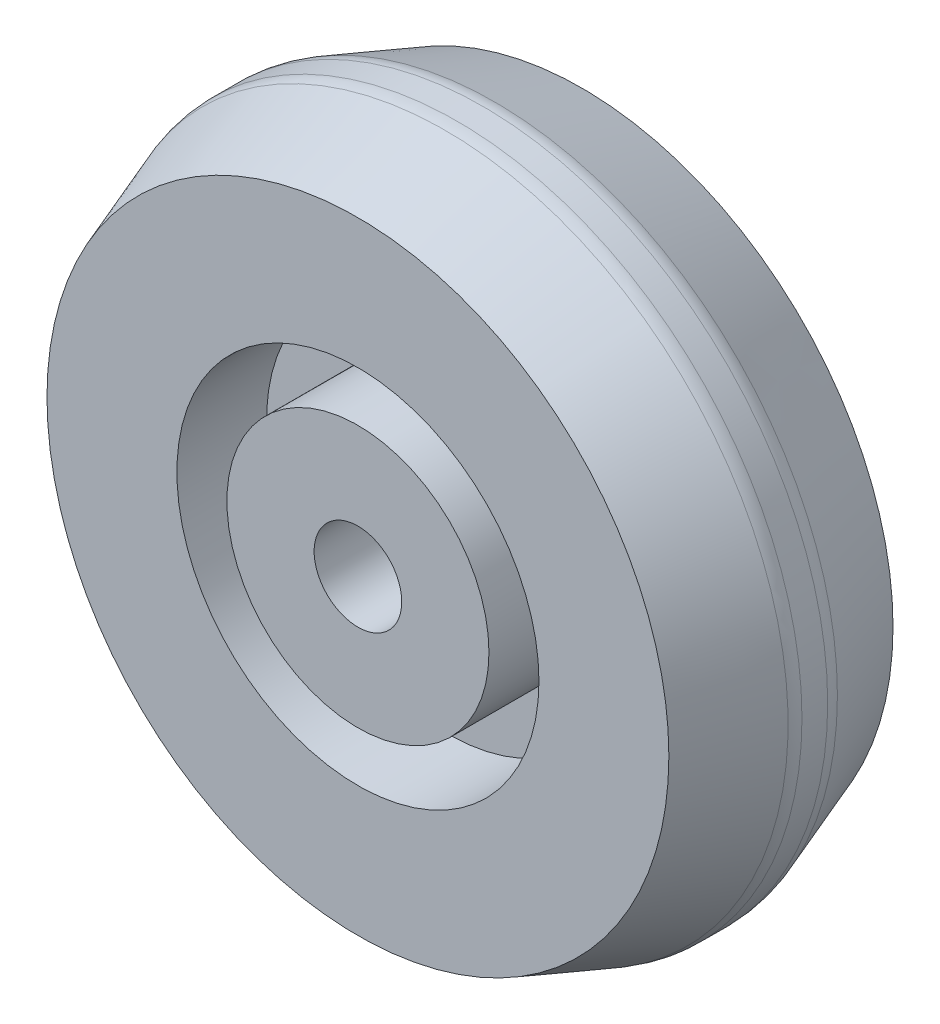
ISO-10303-21;
HEADER;
FILE_DESCRIPTION(('STEP AP214'),'2;1');
FILE_NAME('part.step','',(''),(''),'','','');
FILE_SCHEMA(('AUTOMOTIVE_DESIGN { 1 0 10303 214 1 1 1 1 }'));
ENDSEC;
DATA;
#1=APPLICATION_CONTEXT('core data for automotive mechanical design processes');
#2=APPLICATION_PROTOCOL_DEFINITION('international standard','automotive_design',2000,#1);
#3=PRODUCT_CONTEXT('',#1,'mechanical');
#4=PRODUCT('Part','Part','',(#3));
#5=PRODUCT_RELATED_PRODUCT_CATEGORY('part','',(#4));
#6=PRODUCT_DEFINITION_FORMATION('','',#4);
#7=PRODUCT_DEFINITION_CONTEXT('part definition',#1,'design');
#8=PRODUCT_DEFINITION('design','',#6,#7);
#9=PRODUCT_DEFINITION_SHAPE('','',#8);
#10=(LENGTH_UNIT() NAMED_UNIT(*) SI_UNIT(.MILLI.,.METRE.));
#11=(NAMED_UNIT(*) PLANE_ANGLE_UNIT() SI_UNIT($,.RADIAN.));
#12=(NAMED_UNIT(*) SI_UNIT($,.STERADIAN.) SOLID_ANGLE_UNIT());
#13=UNCERTAINTY_MEASURE_WITH_UNIT(LENGTH_MEASURE(1.E-05),#10,'distance_accuracy_value','');
#14=(GEOMETRIC_REPRESENTATION_CONTEXT(3) GLOBAL_UNCERTAINTY_ASSIGNED_CONTEXT((#13)) GLOBAL_UNIT_ASSIGNED_CONTEXT((#10,
#11,#12)) REPRESENTATION_CONTEXT('',''));
#15=CARTESIAN_POINT('',(0.,0.,0.));
#16=DIRECTION('',(0.,0.,1.));
#17=DIRECTION('',(1.,0.,0.));
#18=AXIS2_PLACEMENT_3D('',#15,#16,#17);
#19=CARTESIAN_POINT('',(0.,0.,-8.255));
#20=DIRECTION('',(0.,0.,1.));
#21=DIRECTION('',(1.,0.,0.));
#22=AXIS2_PLACEMENT_3D('',#19,#20,#21);
#23=PLANE('',#22);
#24=CARTESIAN_POINT('',(0.,0.,-8.255));
#25=DIRECTION('',(0.,0.,1.));
#26=DIRECTION('',(1.,0.,0.));
#27=AXIS2_PLACEMENT_3D('',#24,#25,#26);
#28=CIRCLE('',#27,3.2258);
#29=CARTESIAN_POINT('',(3.2258,0.,-8.255));
#30=VERTEX_POINT('',#29);
#31=EDGE_CURVE('E59',#30,#30,#28,.T.);
#32=ORIENTED_EDGE('',*,*,#31,.T.);
#33=EDGE_LOOP('',(#32));
#34=FACE_BOUND('',#33,.T.);
#35=CARTESIAN_POINT('',(0.,0.,-8.255));
#36=DIRECTION('',(0.,0.,1.));
#37=DIRECTION('',(1.,0.,0.));
#38=AXIS2_PLACEMENT_3D('',#35,#36,#37);
#39=CIRCLE('',#38,9.652);
#40=CARTESIAN_POINT('',(-9.652,0.,-8.255));
#41=VERTEX_POINT('',#40);
#42=EDGE_CURVE('E84',#41,#41,#39,.T.);
#43=ORIENTED_EDGE('',*,*,#42,.F.);
#44=EDGE_LOOP('',(#43));
#45=FACE_BOUND('',#44,.T.);
#46=ADVANCED_FACE('F33',(#34,#45),#23,.F.);
#47=CARTESIAN_POINT('',(0.,0.,8.255));
#48=DIRECTION('',(0.,0.,1.));
#49=DIRECTION('',(1.,0.,0.));
#50=AXIS2_PLACEMENT_3D('',#47,#48,#49);
#51=PLANE('',#50);
#52=CARTESIAN_POINT('',(0.,0.,8.255));
#53=DIRECTION('',(0.,0.,1.));
#54=DIRECTION('',(1.,0.,0.));
#55=AXIS2_PLACEMENT_3D('',#52,#53,#54);
#56=CIRCLE('',#55,3.2258);
#57=CARTESIAN_POINT('',(3.2258,0.,8.255));
#58=VERTEX_POINT('',#57);
#59=EDGE_CURVE('E60',#58,#58,#56,.T.);
#60=ORIENTED_EDGE('',*,*,#59,.F.);
#61=EDGE_LOOP('',(#60));
#62=FACE_BOUND('',#61,.T.);
#63=CARTESIAN_POINT('',(0.,0.,8.255));
#64=DIRECTION('',(0.,0.,1.));
#65=DIRECTION('',(1.,0.,0.));
#66=AXIS2_PLACEMENT_3D('',#63,#64,#65);
#67=CIRCLE('',#66,9.652);
#68=CARTESIAN_POINT('',(9.652,0.,8.255));
#69=VERTEX_POINT('',#68);
#70=EDGE_CURVE('E72',#69,#69,#67,.T.);
#71=ORIENTED_EDGE('',*,*,#70,.T.);
#72=EDGE_LOOP('',(#71));
#73=FACE_BOUND('',#72,.T.);
#74=ADVANCED_FACE('F100',(#62,#73),#51,.T.);
#75=CARTESIAN_POINT('',(0.,0.,8.255));
#76=DIRECTION('',(0.,0.,1.));
#77=DIRECTION('',(1.,0.,0.));
#78=AXIS2_PLACEMENT_3D('',#75,#76,#77);
#79=CIRCLE('',#78,13.335);
#80=CARTESIAN_POINT('',(13.335,0.,8.255));
#81=VERTEX_POINT('',#80);
#82=EDGE_CURVE('E66',#81,#81,#79,.T.);
#83=ORIENTED_EDGE('',*,*,#82,.F.);
#84=EDGE_LOOP('',(#83));
#85=FACE_BOUND('',#84,.T.);
#86=CARTESIAN_POINT('',(0.,0.,8.255));
#87=DIRECTION('',(0.,0.,1.));
#88=DIRECTION('',(1.,0.,0.));
#89=AXIS2_PLACEMENT_3D('',#86,#87,#88);
#90=CIRCLE('',#89,22.9034257161325);
#91=CARTESIAN_POINT('',(22.9034257161325,0.,8.255));
#92=VERTEX_POINT('',#91);
#93=EDGE_CURVE('E56',#92,#92,#90,.F.);
#94=ORIENTED_EDGE('',*,*,#93,.F.);
#95=EDGE_LOOP('',(#94));
#96=FACE_BOUND('',#95,.T.);
#97=ADVANCED_FACE('F107',(#85,#96),#51,.T.);
#98=CARTESIAN_POINT('',(0.,0.,0.));
#99=DIRECTION('',(0.,0.,-1.));
#100=DIRECTION('',(-1.,0.,0.));
#101=AXIS2_PLACEMENT_3D('',#98,#99,#100);
#102=CONICAL_SURFACE('',#101,25.908,0.34906585039887);
#103=CARTESIAN_POINT('',(0.,0.,1.81657916213064));
#104=DIRECTION('',(0.,0.,-1.));
#105=DIRECTION('',(-1.,0.,0.));
#106=AXIS2_PLACEMENT_3D('',#103,#104,#105);
#107=CIRCLE('',#106,25.2468192567962);
#108=CARTESIAN_POINT('',(-25.2468192567962,0.,1.81657916213064));
#109=VERTEX_POINT('',#108);
#110=EDGE_CURVE('E10',#109,#109,#107,.F.);
#111=ORIENTED_EDGE('',*,*,#110,.T.);
#112=EDGE_LOOP('',(#111));
#113=FACE_BOUND('',#112,.T.);
#114=ORIENTED_EDGE('',*,*,#93,.T.);
#115=EDGE_LOOP('',(#114));
#116=FACE_BOUND('',#115,.T.);
#117=ADVANCED_FACE('F152',(#113,#116),#102,.T.);
#118=CARTESIAN_POINT('',(0.,0.,-8.255));
#119=DIRECTION('',(0.,0.,1.));
#120=DIRECTION('',(1.,0.,0.));
#121=AXIS2_PLACEMENT_3D('',#118,#119,#120);
#122=CYLINDRICAL_SURFACE('',#121,25.4);
#123=CARTESIAN_POINT('',(0.,0.,-0.94784799808342));
#124=DIRECTION('',(0.,0.,1.));
#125=DIRECTION('',(1.,0.,0.));
#126=AXIS2_PLACEMENT_3D('',#123,#124,#125);
#127=CIRCLE('',#126,25.4);
#128=CARTESIAN_POINT('',(25.4,0.,-0.94784799808342));
#129=VERTEX_POINT('',#128);
#130=EDGE_CURVE('E40',#129,#129,#127,.T.);
#131=ORIENTED_EDGE('',*,*,#130,.T.);
#132=EDGE_LOOP('',(#131));
#133=FACE_BOUND('',#132,.T.);
#134=CARTESIAN_POINT('',(0.,0.,0.947847998083434));
#135=DIRECTION('',(0.,0.,-1.));
#136=DIRECTION('',(-1.,0.,0.));
#137=AXIS2_PLACEMENT_3D('',#134,#135,#136);
#138=CIRCLE('',#137,25.4);
#139=CARTESIAN_POINT('',(-25.4,0.,0.947847998083434));
#140=VERTEX_POINT('',#139);
#141=EDGE_CURVE('E44',#140,#140,#138,.T.);
#142=ORIENTED_EDGE('',*,*,#141,.T.);
#143=EDGE_LOOP('',(#142));
#144=FACE_BOUND('',#143,.T.);
#145=ADVANCED_FACE('F120',(#133,#144),#122,.T.);
#146=CARTESIAN_POINT('',(0.,0.,-14.3209155407772));
#147=DIRECTION('',(0.,0.,1.));
#148=DIRECTION('',(1.,0.,0.));
#149=AXIS2_PLACEMENT_3D('',#146,#147,#148);
#150=CONICAL_SURFACE('',#149,20.6956130157168,0.34906585039887);
#151=CARTESIAN_POINT('',(0.,0.,-1.81657916213062));
#152=DIRECTION('',(0.,0.,1.));
#153=DIRECTION('',(1.,0.,0.));
#154=AXIS2_PLACEMENT_3D('',#151,#152,#153);
#155=CIRCLE('',#154,25.2468192567962);
#156=CARTESIAN_POINT('',(25.2468192567962,0.,-1.81657916213062));
#157=VERTEX_POINT('',#156);
#158=EDGE_CURVE('E48',#157,#157,#155,.F.);
#159=ORIENTED_EDGE('',*,*,#158,.T.);
#160=EDGE_LOOP('',(#159));
#161=FACE_BOUND('',#160,.T.);
#162=CARTESIAN_POINT('',(0.,0.,-8.255));
#163=DIRECTION('',(0.,0.,1.));
#164=DIRECTION('',(1.,0.,0.));
#165=AXIS2_PLACEMENT_3D('',#162,#163,#164);
#166=CIRCLE('',#165,22.9034257161325);
#167=CARTESIAN_POINT('',(22.9034257161325,0.,-8.255));
#168=VERTEX_POINT('',#167);
#169=EDGE_CURVE('E53',#168,#168,#166,.F.);
#170=ORIENTED_EDGE('',*,*,#169,.F.);
#171=EDGE_LOOP('',(#170));
#172=FACE_BOUND('',#171,.T.);
#173=ADVANCED_FACE('F113',(#161,#172),#150,.T.);
#174=CARTESIAN_POINT('',(0.,0.,-8.255));
#175=DIRECTION('',(0.,0.,1.));
#176=DIRECTION('',(1.,0.,0.));
#177=AXIS2_PLACEMENT_3D('',#174,#175,#176);
#178=CIRCLE('',#177,13.335);
#179=CARTESIAN_POINT('',(-13.335,0.,-8.255));
#180=VERTEX_POINT('',#179);
#181=EDGE_CURVE('E78',#180,#180,#178,.T.);
#182=ORIENTED_EDGE('',*,*,#181,.T.);
#183=EDGE_LOOP('',(#182));
#184=FACE_BOUND('',#183,.T.);
#185=ORIENTED_EDGE('',*,*,#169,.T.);
#186=EDGE_LOOP('',(#185));
#187=FACE_BOUND('',#186,.T.);
#188=ADVANCED_FACE('F103',(#184,#187),#23,.F.);
#189=CARTESIAN_POINT('',(0.,0.,-0.94784799808342));
#190=DIRECTION('',(0.,0.,1.));
#191=DIRECTION('',(1.,0.,0.));
#192=AXIS2_PLACEMENT_3D('',#189,#190,#191);
#193=TOROIDAL_SURFACE('',#192,22.86,2.54);
#194=ORIENTED_EDGE('',*,*,#130,.F.);
#195=EDGE_LOOP('',(#194));
#196=FACE_BOUND('',#195,.T.);
#197=ORIENTED_EDGE('',*,*,#158,.F.);
#198=EDGE_LOOP('',(#197));
#199=FACE_BOUND('',#198,.T.);
#200=ADVANCED_FACE('F112',(#196,#199),#193,.T.);
#201=CARTESIAN_POINT('',(0.,0.,0.947847998083434));
#202=DIRECTION('',(0.,0.,-1.));
#203=DIRECTION('',(-1.,0.,0.));
#204=AXIS2_PLACEMENT_3D('',#201,#202,#203);
#205=TOROIDAL_SURFACE('',#204,22.86,2.54);
#206=ORIENTED_EDGE('',*,*,#141,.F.);
#207=EDGE_LOOP('',(#206));
#208=FACE_BOUND('',#207,.T.);
#209=ORIENTED_EDGE('',*,*,#110,.F.);
#210=EDGE_LOOP('',(#209));
#211=FACE_BOUND('',#210,.T.);
#212=ADVANCED_FACE('F35',(#208,#211),#205,.T.);
#213=CARTESIAN_POINT('',(0.,0.,-8.255));
#214=DIRECTION('',(0.,0.,1.));
#215=DIRECTION('',(1.,0.,0.));
#216=AXIS2_PLACEMENT_3D('',#213,#214,#215);
#217=CYLINDRICAL_SURFACE('',#216,3.2258);
#218=ORIENTED_EDGE('',*,*,#31,.F.);
#219=EDGE_LOOP('',(#218));
#220=FACE_BOUND('',#219,.T.);
#221=ORIENTED_EDGE('',*,*,#59,.T.);
#222=EDGE_LOOP('',(#221));
#223=FACE_BOUND('',#222,.T.);
#224=ADVANCED_FACE('F147',(#220,#223),#217,.F.);
#225=CARTESIAN_POINT('',(0.,0.,1.651));
#226=DIRECTION('',(0.,0.,1.));
#227=DIRECTION('',(1.,0.,0.));
#228=AXIS2_PLACEMENT_3D('',#225,#226,#227);
#229=CYLINDRICAL_SURFACE('',#228,13.335);
#230=CARTESIAN_POINT('',(0.,0.,1.651));
#231=DIRECTION('',(0.,0.,1.));
#232=DIRECTION('',(1.,0.,0.));
#233=AXIS2_PLACEMENT_3D('',#230,#231,#232);
#234=CIRCLE('',#233,13.335);
#235=CARTESIAN_POINT('',(13.335,0.,1.651));
#236=VERTEX_POINT('',#235);
#237=EDGE_CURVE('E63',#236,#236,#234,.T.);
#238=CARTESIAN_POINT('',(13.335,0.,1.651));
#239=CARTESIAN_POINT('',(13.335,0.,1.71979166666667));
#240=CARTESIAN_POINT('',(13.335,0.,1.78858333333333));
#241=CARTESIAN_POINT('',(13.335,0.,1.92616666666667));
#242=CARTESIAN_POINT('',(13.335,0.,1.99495833333333));
#243=CARTESIAN_POINT('',(13.335,0.,2.13254166666667));
#244=CARTESIAN_POINT('',(13.335,0.,2.20133333333333));
#245=CARTESIAN_POINT('',(13.335,0.,2.33891666666667));
#246=CARTESIAN_POINT('',(13.335,0.,2.40770833333333));
#247=CARTESIAN_POINT('',(13.335,0.,2.54529166666667));
#248=CARTESIAN_POINT('',(13.335,0.,2.61408333333333));
#249=CARTESIAN_POINT('',(13.335,0.,2.75166666666667));
#250=CARTESIAN_POINT('',(13.335,0.,2.82045833333333));
#251=CARTESIAN_POINT('',(13.335,0.,2.95804166666667));
#252=CARTESIAN_POINT('',(13.335,0.,3.02683333333333));
#253=CARTESIAN_POINT('',(13.335,0.,3.16441666666667));
#254=CARTESIAN_POINT('',(13.335,0.,3.23320833333333));
#255=CARTESIAN_POINT('',(13.335,0.,3.37079166666667));
#256=CARTESIAN_POINT('',(13.335,0.,3.43958333333333));
#257=CARTESIAN_POINT('',(13.335,0.,3.57716666666667));
#258=CARTESIAN_POINT('',(13.335,0.,3.64595833333333));
#259=CARTESIAN_POINT('',(13.335,0.,3.78354166666667));
#260=CARTESIAN_POINT('',(13.335,0.,3.85233333333333));
#261=CARTESIAN_POINT('',(13.335,0.,3.98991666666667));
#262=CARTESIAN_POINT('',(13.335,0.,4.05870833333333));
#263=CARTESIAN_POINT('',(13.335,0.,4.19629166666667));
#264=CARTESIAN_POINT('',(13.335,0.,4.26508333333333));
#265=CARTESIAN_POINT('',(13.335,0.,4.40266666666667));
#266=CARTESIAN_POINT('',(13.335,0.,4.47145833333333));
#267=CARTESIAN_POINT('',(13.335,0.,4.60904166666667));
#268=CARTESIAN_POINT('',(13.335,0.,4.67783333333333));
#269=CARTESIAN_POINT('',(13.335,0.,4.81541666666667));
#270=CARTESIAN_POINT('',(13.335,0.,4.88420833333333));
#271=CARTESIAN_POINT('',(13.335,0.,5.02179166666667));
#272=CARTESIAN_POINT('',(13.335,0.,5.09058333333333));
#273=CARTESIAN_POINT('',(13.335,0.,5.22816666666667));
#274=CARTESIAN_POINT('',(13.335,0.,5.29695833333333));
#275=CARTESIAN_POINT('',(13.335,0.,5.43454166666667));
#276=CARTESIAN_POINT('',(13.335,0.,5.50333333333333));
#277=CARTESIAN_POINT('',(13.335,0.,5.64091666666667));
#278=CARTESIAN_POINT('',(13.335,0.,5.70970833333333));
#279=CARTESIAN_POINT('',(13.335,0.,5.84729166666667));
#280=CARTESIAN_POINT('',(13.335,0.,5.91608333333333));
#281=CARTESIAN_POINT('',(13.335,0.,6.05366666666667));
#282=CARTESIAN_POINT('',(13.335,0.,6.12245833333333));
#283=CARTESIAN_POINT('',(13.335,0.,6.26004166666667));
#284=CARTESIAN_POINT('',(13.335,0.,6.32883333333333));
#285=CARTESIAN_POINT('',(13.335,0.,6.46641666666667));
#286=CARTESIAN_POINT('',(13.335,0.,6.53520833333333));
#287=CARTESIAN_POINT('',(13.335,0.,6.67279166666667));
#288=CARTESIAN_POINT('',(13.335,0.,6.74158333333333));
#289=CARTESIAN_POINT('',(13.335,0.,6.87916666666667));
#290=CARTESIAN_POINT('',(13.335,0.,6.94795833333333));
#291=CARTESIAN_POINT('',(13.335,0.,7.08554166666667));
#292=CARTESIAN_POINT('',(13.335,0.,7.15433333333333));
#293=CARTESIAN_POINT('',(13.335,0.,7.29191666666667));
#294=CARTESIAN_POINT('',(13.335,0.,7.36070833333333));
#295=CARTESIAN_POINT('',(13.335,0.,7.49829166666667));
#296=CARTESIAN_POINT('',(13.335,0.,7.56708333333333));
#297=CARTESIAN_POINT('',(13.335,0.,7.70466666666667));
#298=CARTESIAN_POINT('',(13.335,0.,7.77345833333333));
#299=CARTESIAN_POINT('',(13.335,0.,7.91104166666667));
#300=CARTESIAN_POINT('',(13.335,0.,7.97983333333333));
#301=CARTESIAN_POINT('',(13.335,0.,8.11741666666667));
#302=CARTESIAN_POINT('',(13.335,0.,8.18620833333333));
#303=CARTESIAN_POINT('',(13.335,0.,8.255));
#304=B_SPLINE_CURVE_WITH_KNOTS('',3,(#238,#239,#240,#241,#242,#243,#244,#245,#246,#247,#248,
#249,#250,#251,#252,#253,#254,#255,#256,#257,#258,#259,#260,#261,#262,#263,#264,#265,#266,#267,
#268,#269,#270,#271,#272,#273,#274,#275,#276,#277,#278,#279,#280,#281,#282,#283,#284,#285,#286,
#287,#288,#289,#290,#291,#292,#293,#294,#295,#296,#297,#298,#299,#300,#301,#302,#303),
.UNSPECIFIED.,.F.,.F.,(4,2,2,2,2,2,2,2,2,2,2,2,2,2,2,2,2,2,2,2,2,2,2,2,2,2,2,2,2,2,2,2,4),(0.,
0.206375,0.41275,0.619125,0.8255,1.031875,1.23825,1.444625,1.651,1.857375,2.06375,2.270125,
2.4765,2.682875,2.88925,3.095625,3.302,3.508375,3.71475,3.921125,4.1275,4.333875,4.54025,
4.746625,4.953,5.159375,5.36575,5.572125,5.7785,5.984875,6.19125,6.397625,6.604),.UNSPECIFIED.);
#305=EDGE_CURVE('BSEAM143',#236,#81,#304,.T.);
#306=ORIENTED_EDGE('',*,*,#237,.F.);
#307=ORIENTED_EDGE('',*,*,#82,.T.);
#308=ORIENTED_EDGE('',*,*,#305,.T.);
#309=ORIENTED_EDGE('',*,*,#305,.F.);
#310=EDGE_LOOP('',(#306,#308,#307,#309));
#311=FACE_BOUND('',#310,.T.);
#312=ADVANCED_FACE('F143',(#311),#229,.F.);
#313=CARTESIAN_POINT('',(0.,0.,1.651));
#314=DIRECTION('',(0.,0.,1.));
#315=DIRECTION('',(1.,0.,0.));
#316=AXIS2_PLACEMENT_3D('',#313,#314,#315);
#317=PLANE('',#316);
#318=CARTESIAN_POINT('',(0.,0.,1.651));
#319=DIRECTION('',(0.,0.,1.));
#320=DIRECTION('',(1.,0.,0.));
#321=AXIS2_PLACEMENT_3D('',#318,#319,#320);
#322=CIRCLE('',#321,9.652);
#323=CARTESIAN_POINT('',(9.652,0.,1.651));
#324=VERTEX_POINT('',#323);
#325=EDGE_CURVE('E69',#324,#324,#322,.T.);
#326=ORIENTED_EDGE('',*,*,#325,.F.);
#327=EDGE_LOOP('',(#326));
#328=FACE_BOUND('',#327,.T.);
#329=ORIENTED_EDGE('',*,*,#237,.T.);
#330=EDGE_LOOP('',(#329));
#331=FACE_BOUND('',#330,.T.);
#332=ADVANCED_FACE('F139',(#328,#331),#317,.T.);
#333=CARTESIAN_POINT('',(0.,0.,1.651));
#334=DIRECTION('',(0.,0.,1.));
#335=DIRECTION('',(1.,0.,0.));
#336=AXIS2_PLACEMENT_3D('',#333,#334,#335);
#337=CYLINDRICAL_SURFACE('',#336,9.652);
#338=CARTESIAN_POINT('',(9.652,0.,1.651));
#339=CARTESIAN_POINT('',(9.652,0.,1.71979166666667));
#340=CARTESIAN_POINT('',(9.652,0.,1.78858333333333));
#341=CARTESIAN_POINT('',(9.652,0.,1.92616666666667));
#342=CARTESIAN_POINT('',(9.652,0.,1.99495833333333));
#343=CARTESIAN_POINT('',(9.652,0.,2.13254166666667));
#344=CARTESIAN_POINT('',(9.652,0.,2.20133333333333));
#345=CARTESIAN_POINT('',(9.652,0.,2.33891666666667));
#346=CARTESIAN_POINT('',(9.652,0.,2.40770833333333));
#347=CARTESIAN_POINT('',(9.652,0.,2.54529166666667));
#348=CARTESIAN_POINT('',(9.652,0.,2.61408333333333));
#349=CARTESIAN_POINT('',(9.652,0.,2.75166666666667));
#350=CARTESIAN_POINT('',(9.652,0.,2.82045833333333));
#351=CARTESIAN_POINT('',(9.652,0.,2.95804166666667));
#352=CARTESIAN_POINT('',(9.652,0.,3.02683333333333));
#353=CARTESIAN_POINT('',(9.652,0.,3.16441666666667));
#354=CARTESIAN_POINT('',(9.652,0.,3.23320833333333));
#355=CARTESIAN_POINT('',(9.652,0.,3.37079166666667));
#356=CARTESIAN_POINT('',(9.652,0.,3.43958333333333));
#357=CARTESIAN_POINT('',(9.652,0.,3.57716666666667));
#358=CARTESIAN_POINT('',(9.652,0.,3.64595833333333));
#359=CARTESIAN_POINT('',(9.652,0.,3.78354166666667));
#360=CARTESIAN_POINT('',(9.652,0.,3.85233333333333));
#361=CARTESIAN_POINT('',(9.652,0.,3.98991666666667));
#362=CARTESIAN_POINT('',(9.652,0.,4.05870833333333));
#363=CARTESIAN_POINT('',(9.652,0.,4.19629166666667));
#364=CARTESIAN_POINT('',(9.652,0.,4.26508333333333));
#365=CARTESIAN_POINT('',(9.652,0.,4.40266666666667));
#366=CARTESIAN_POINT('',(9.652,0.,4.47145833333333));
#367=CARTESIAN_POINT('',(9.652,0.,4.60904166666667));
#368=CARTESIAN_POINT('',(9.652,0.,4.67783333333333));
#369=CARTESIAN_POINT('',(9.652,0.,4.81541666666667));
#370=CARTESIAN_POINT('',(9.652,0.,4.88420833333333));
#371=CARTESIAN_POINT('',(9.652,0.,5.02179166666667));
#372=CARTESIAN_POINT('',(9.652,0.,5.09058333333333));
#373=CARTESIAN_POINT('',(9.652,0.,5.22816666666667));
#374=CARTESIAN_POINT('',(9.652,0.,5.29695833333333));
#375=CARTESIAN_POINT('',(9.652,0.,5.43454166666667));
#376=CARTESIAN_POINT('',(9.652,0.,5.50333333333333));
#377=CARTESIAN_POINT('',(9.652,0.,5.64091666666667));
#378=CARTESIAN_POINT('',(9.652,0.,5.70970833333333));
#379=CARTESIAN_POINT('',(9.652,0.,5.84729166666667));
#380=CARTESIAN_POINT('',(9.652,0.,5.91608333333333));
#381=CARTESIAN_POINT('',(9.652,0.,6.05366666666667));
#382=CARTESIAN_POINT('',(9.652,0.,6.12245833333333));
#383=CARTESIAN_POINT('',(9.652,0.,6.26004166666667));
#384=CARTESIAN_POINT('',(9.652,0.,6.32883333333333));
#385=CARTESIAN_POINT('',(9.652,0.,6.46641666666667));
#386=CARTESIAN_POINT('',(9.652,0.,6.53520833333333));
#387=CARTESIAN_POINT('',(9.652,0.,6.67279166666667));
#388=CARTESIAN_POINT('',(9.652,0.,6.74158333333333));
#389=CARTESIAN_POINT('',(9.652,0.,6.87916666666667));
#390=CARTESIAN_POINT('',(9.652,0.,6.94795833333333));
#391=CARTESIAN_POINT('',(9.652,0.,7.08554166666667));
#392=CARTESIAN_POINT('',(9.652,0.,7.15433333333333));
#393=CARTESIAN_POINT('',(9.652,0.,7.29191666666667));
#394=CARTESIAN_POINT('',(9.652,0.,7.36070833333333));
#395=CARTESIAN_POINT('',(9.652,0.,7.49829166666667));
#396=CARTESIAN_POINT('',(9.652,0.,7.56708333333333));
#397=CARTESIAN_POINT('',(9.652,0.,7.70466666666667));
#398=CARTESIAN_POINT('',(9.652,0.,7.77345833333333));
#399=CARTESIAN_POINT('',(9.652,0.,7.91104166666667));
#400=CARTESIAN_POINT('',(9.652,0.,7.97983333333333));
#401=CARTESIAN_POINT('',(9.652,0.,8.11741666666667));
#402=CARTESIAN_POINT('',(9.652,0.,8.18620833333333));
#403=CARTESIAN_POINT('',(9.652,0.,8.255));
#404=B_SPLINE_CURVE_WITH_KNOTS('',3,(#338,#339,#340,#341,#342,#343,#344,#345,#346,#347,#348,
#349,#350,#351,#352,#353,#354,#355,#356,#357,#358,#359,#360,#361,#362,#363,#364,#365,#366,#367,
#368,#369,#370,#371,#372,#373,#374,#375,#376,#377,#378,#379,#380,#381,#382,#383,#384,#385,#386,
#387,#388,#389,#390,#391,#392,#393,#394,#395,#396,#397,#398,#399,#400,#401,#402,#403),
.UNSPECIFIED.,.F.,.F.,(4,2,2,2,2,2,2,2,2,2,2,2,2,2,2,2,2,2,2,2,2,2,2,2,2,2,2,2,2,2,2,2,4),(0.,
0.206375,0.41275,0.619125,0.8255,1.031875,1.23825,1.444625,1.651,1.857375,2.06375,2.270125,
2.4765,2.682875,2.88925,3.095625,3.302,3.508375,3.71475,3.921125,4.1275,4.333875,4.54025,
4.746625,4.953,5.159375,5.36575,5.572125,5.7785,5.984875,6.19125,6.397625,6.604),.UNSPECIFIED.);
#405=EDGE_CURVE('BSEAM133',#324,#69,#404,.T.);
#406=ORIENTED_EDGE('',*,*,#325,.T.);
#407=ORIENTED_EDGE('',*,*,#70,.F.);
#408=ORIENTED_EDGE('',*,*,#405,.T.);
#409=ORIENTED_EDGE('',*,*,#405,.F.);
#410=EDGE_LOOP('',(#406,#408,#407,#409));
#411=FACE_BOUND('',#410,.T.);
#412=ADVANCED_FACE('F133',(#411),#337,.T.);
#413=CARTESIAN_POINT('',(0.,0.,-1.651));
#414=DIRECTION('',(0.,0.,-1.));
#415=DIRECTION('',(1.,0.,0.));
#416=AXIS2_PLACEMENT_3D('',#413,#414,#415);
#417=PLANE('',#416);
#418=CARTESIAN_POINT('',(0.,0.,-1.651));
#419=DIRECTION('',(0.,0.,1.));
#420=DIRECTION('',(1.,0.,0.));
#421=AXIS2_PLACEMENT_3D('',#418,#419,#420);
#422=CIRCLE('',#421,13.335);
#423=CARTESIAN_POINT('',(-13.335,0.,-1.651));
#424=VERTEX_POINT('',#423);
#425=EDGE_CURVE('E75',#424,#424,#422,.T.);
#426=ORIENTED_EDGE('',*,*,#425,.F.);
#427=EDGE_LOOP('',(#426));
#428=FACE_BOUND('',#427,.T.);
#429=CARTESIAN_POINT('',(0.,0.,-1.651));
#430=DIRECTION('',(0.,0.,1.));
#431=DIRECTION('',(1.,0.,0.));
#432=AXIS2_PLACEMENT_3D('',#429,#430,#431);
#433=CIRCLE('',#432,9.652);
#434=CARTESIAN_POINT('',(-9.652,0.,-1.651));
#435=VERTEX_POINT('',#434);
#436=EDGE_CURVE('E81',#435,#435,#433,.T.);
#437=ORIENTED_EDGE('',*,*,#436,.T.);
#438=EDGE_LOOP('',(#437));
#439=FACE_BOUND('',#438,.T.);
#440=ADVANCED_FACE('F90',(#428,#439),#417,.T.);
#441=CARTESIAN_POINT('',(0.,0.,-1.651));
#442=DIRECTION('',(0.,0.,-1.));
#443=DIRECTION('',(-1.,0.,0.));
#444=AXIS2_PLACEMENT_3D('',#441,#442,#443);
#445=CYLINDRICAL_SURFACE('',#444,13.335);
#446=CARTESIAN_POINT('',(-13.335,0.,-1.651));
#447=CARTESIAN_POINT('',(-13.335,0.,-1.71979166666667));
#448=CARTESIAN_POINT('',(-13.335,0.,-1.78858333333333));
#449=CARTESIAN_POINT('',(-13.335,0.,-1.92616666666667));
#450=CARTESIAN_POINT('',(-13.335,0.,-1.99495833333333));
#451=CARTESIAN_POINT('',(-13.335,0.,-2.13254166666667));
#452=CARTESIAN_POINT('',(-13.335,0.,-2.20133333333333));
#453=CARTESIAN_POINT('',(-13.335,0.,-2.33891666666667));
#454=CARTESIAN_POINT('',(-13.335,0.,-2.40770833333333));
#455=CARTESIAN_POINT('',(-13.335,0.,-2.54529166666667));
#456=CARTESIAN_POINT('',(-13.335,0.,-2.61408333333333));
#457=CARTESIAN_POINT('',(-13.335,0.,-2.75166666666667));
#458=CARTESIAN_POINT('',(-13.335,0.,-2.82045833333333));
#459=CARTESIAN_POINT('',(-13.335,0.,-2.95804166666667));
#460=CARTESIAN_POINT('',(-13.335,0.,-3.02683333333333));
#461=CARTESIAN_POINT('',(-13.335,0.,-3.16441666666667));
#462=CARTESIAN_POINT('',(-13.335,0.,-3.23320833333333));
#463=CARTESIAN_POINT('',(-13.335,0.,-3.37079166666667));
#464=CARTESIAN_POINT('',(-13.335,0.,-3.43958333333333));
#465=CARTESIAN_POINT('',(-13.335,0.,-3.57716666666667));
#466=CARTESIAN_POINT('',(-13.335,0.,-3.64595833333333));
#467=CARTESIAN_POINT('',(-13.335,0.,-3.78354166666667));
#468=CARTESIAN_POINT('',(-13.335,0.,-3.85233333333333));
#469=CARTESIAN_POINT('',(-13.335,0.,-3.98991666666667));
#470=CARTESIAN_POINT('',(-13.335,0.,-4.05870833333333));
#471=CARTESIAN_POINT('',(-13.335,0.,-4.19629166666667));
#472=CARTESIAN_POINT('',(-13.335,0.,-4.26508333333333));
#473=CARTESIAN_POINT('',(-13.335,0.,-4.40266666666667));
#474=CARTESIAN_POINT('',(-13.335,0.,-4.47145833333333));
#475=CARTESIAN_POINT('',(-13.335,0.,-4.60904166666667));
#476=CARTESIAN_POINT('',(-13.335,0.,-4.67783333333333));
#477=CARTESIAN_POINT('',(-13.335,0.,-4.81541666666667));
#478=CARTESIAN_POINT('',(-13.335,0.,-4.88420833333333));
#479=CARTESIAN_POINT('',(-13.335,0.,-5.02179166666667));
#480=CARTESIAN_POINT('',(-13.335,0.,-5.09058333333333));
#481=CARTESIAN_POINT('',(-13.335,0.,-5.22816666666667));
#482=CARTESIAN_POINT('',(-13.335,0.,-5.29695833333333));
#483=CARTESIAN_POINT('',(-13.335,0.,-5.43454166666667));
#484=CARTESIAN_POINT('',(-13.335,0.,-5.50333333333333));
#485=CARTESIAN_POINT('',(-13.335,0.,-5.64091666666667));
#486=CARTESIAN_POINT('',(-13.335,0.,-5.70970833333333));
#487=CARTESIAN_POINT('',(-13.335,0.,-5.84729166666667));
#488=CARTESIAN_POINT('',(-13.335,0.,-5.91608333333333));
#489=CARTESIAN_POINT('',(-13.335,0.,-6.05366666666667));
#490=CARTESIAN_POINT('',(-13.335,0.,-6.12245833333333));
#491=CARTESIAN_POINT('',(-13.335,0.,-6.26004166666667));
#492=CARTESIAN_POINT('',(-13.335,0.,-6.32883333333333));
#493=CARTESIAN_POINT('',(-13.335,0.,-6.46641666666667));
#494=CARTESIAN_POINT('',(-13.335,0.,-6.53520833333333));
#495=CARTESIAN_POINT('',(-13.335,0.,-6.67279166666667));
#496=CARTESIAN_POINT('',(-13.335,0.,-6.74158333333333));
#497=CARTESIAN_POINT('',(-13.335,0.,-6.87916666666667));
#498=CARTESIAN_POINT('',(-13.335,0.,-6.94795833333333));
#499=CARTESIAN_POINT('',(-13.335,0.,-7.08554166666667));
#500=CARTESIAN_POINT('',(-13.335,0.,-7.15433333333333));
#501=CARTESIAN_POINT('',(-13.335,0.,-7.29191666666667));
#502=CARTESIAN_POINT('',(-13.335,0.,-7.36070833333333));
#503=CARTESIAN_POINT('',(-13.335,0.,-7.49829166666667));
#504=CARTESIAN_POINT('',(-13.335,0.,-7.56708333333333));
#505=CARTESIAN_POINT('',(-13.335,0.,-7.70466666666667));
#506=CARTESIAN_POINT('',(-13.335,0.,-7.77345833333333));
#507=CARTESIAN_POINT('',(-13.335,0.,-7.91104166666667));
#508=CARTESIAN_POINT('',(-13.335,0.,-7.97983333333333));
#509=CARTESIAN_POINT('',(-13.335,0.,-8.11741666666667));
#510=CARTESIAN_POINT('',(-13.335,0.,-8.18620833333333));
#511=CARTESIAN_POINT('',(-13.335,0.,-8.255));
#512=B_SPLINE_CURVE_WITH_KNOTS('',3,(#446,#447,#448,#449,#450,#451,#452,#453,#454,#455,#456,
#457,#458,#459,#460,#461,#462,#463,#464,#465,#466,#467,#468,#469,#470,#471,#472,#473,#474,#475,
#476,#477,#478,#479,#480,#481,#482,#483,#484,#485,#486,#487,#488,#489,#490,#491,#492,#493,#494,
#495,#496,#497,#498,#499,#500,#501,#502,#503,#504,#505,#506,#507,#508,#509,#510,#511),
.UNSPECIFIED.,.F.,.F.,(4,2,2,2,2,2,2,2,2,2,2,2,2,2,2,2,2,2,2,2,2,2,2,2,2,2,2,2,2,2,2,2,4),(0.,
0.206375,0.41275,0.619125,0.8255,1.031875,1.23825,1.444625,1.651,1.857375,2.06375,2.270125,
2.4765,2.682875,2.88925,3.095625,3.302,3.508375,3.71475,3.921125,4.1275,4.333875,4.54025,
4.746625,4.953,5.159375,5.36575,5.572125,5.7785,5.984875,6.19125,6.397625,6.604),.UNSPECIFIED.);
#513=EDGE_CURVE('BSEAM95',#424,#180,#512,.T.);
#514=ORIENTED_EDGE('',*,*,#425,.T.);
#515=ORIENTED_EDGE('',*,*,#181,.F.);
#516=ORIENTED_EDGE('',*,*,#513,.T.);
#517=ORIENTED_EDGE('',*,*,#513,.F.);
#518=EDGE_LOOP('',(#514,#516,#515,#517));
#519=FACE_BOUND('',#518,.T.);
#520=ADVANCED_FACE('F95',(#519),#445,.F.);
#521=CARTESIAN_POINT('',(0.,0.,-1.651));
#522=DIRECTION('',(0.,0.,-1.));
#523=DIRECTION('',(-1.,0.,0.));
#524=AXIS2_PLACEMENT_3D('',#521,#522,#523);
#525=CYLINDRICAL_SURFACE('',#524,9.652);
#526=CARTESIAN_POINT('',(-9.652,0.,-1.651));
#527=CARTESIAN_POINT('',(-9.652,0.,-1.71979166666667));
#528=CARTESIAN_POINT('',(-9.652,0.,-1.78858333333333));
#529=CARTESIAN_POINT('',(-9.652,0.,-1.92616666666667));
#530=CARTESIAN_POINT('',(-9.652,0.,-1.99495833333333));
#531=CARTESIAN_POINT('',(-9.652,0.,-2.13254166666667));
#532=CARTESIAN_POINT('',(-9.652,0.,-2.20133333333333));
#533=CARTESIAN_POINT('',(-9.652,0.,-2.33891666666667));
#534=CARTESIAN_POINT('',(-9.652,0.,-2.40770833333333));
#535=CARTESIAN_POINT('',(-9.652,0.,-2.54529166666667));
#536=CARTESIAN_POINT('',(-9.652,0.,-2.61408333333333));
#537=CARTESIAN_POINT('',(-9.652,0.,-2.75166666666667));
#538=CARTESIAN_POINT('',(-9.652,0.,-2.82045833333333));
#539=CARTESIAN_POINT('',(-9.652,0.,-2.95804166666667));
#540=CARTESIAN_POINT('',(-9.652,0.,-3.02683333333333));
#541=CARTESIAN_POINT('',(-9.652,0.,-3.16441666666667));
#542=CARTESIAN_POINT('',(-9.652,0.,-3.23320833333333));
#543=CARTESIAN_POINT('',(-9.652,0.,-3.37079166666667));
#544=CARTESIAN_POINT('',(-9.652,0.,-3.43958333333333));
#545=CARTESIAN_POINT('',(-9.652,0.,-3.57716666666667));
#546=CARTESIAN_POINT('',(-9.652,0.,-3.64595833333333));
#547=CARTESIAN_POINT('',(-9.652,0.,-3.78354166666667));
#548=CARTESIAN_POINT('',(-9.652,0.,-3.85233333333333));
#549=CARTESIAN_POINT('',(-9.652,0.,-3.98991666666667));
#550=CARTESIAN_POINT('',(-9.652,0.,-4.05870833333333));
#551=CARTESIAN_POINT('',(-9.652,0.,-4.19629166666667));
#552=CARTESIAN_POINT('',(-9.652,0.,-4.26508333333333));
#553=CARTESIAN_POINT('',(-9.652,0.,-4.40266666666667));
#554=CARTESIAN_POINT('',(-9.652,0.,-4.47145833333333));
#555=CARTESIAN_POINT('',(-9.652,0.,-4.60904166666667));
#556=CARTESIAN_POINT('',(-9.652,0.,-4.67783333333333));
#557=CARTESIAN_POINT('',(-9.652,0.,-4.81541666666667));
#558=CARTESIAN_POINT('',(-9.652,0.,-4.88420833333333));
#559=CARTESIAN_POINT('',(-9.652,0.,-5.02179166666667));
#560=CARTESIAN_POINT('',(-9.652,0.,-5.09058333333333));
#561=CARTESIAN_POINT('',(-9.652,0.,-5.22816666666667));
#562=CARTESIAN_POINT('',(-9.652,0.,-5.29695833333333));
#563=CARTESIAN_POINT('',(-9.652,0.,-5.43454166666667));
#564=CARTESIAN_POINT('',(-9.652,0.,-5.50333333333333));
#565=CARTESIAN_POINT('',(-9.652,0.,-5.64091666666667));
#566=CARTESIAN_POINT('',(-9.652,0.,-5.70970833333333));
#567=CARTESIAN_POINT('',(-9.652,0.,-5.84729166666667));
#568=CARTESIAN_POINT('',(-9.652,0.,-5.91608333333333));
#569=CARTESIAN_POINT('',(-9.652,0.,-6.05366666666667));
#570=CARTESIAN_POINT('',(-9.652,0.,-6.12245833333333));
#571=CARTESIAN_POINT('',(-9.652,0.,-6.26004166666667));
#572=CARTESIAN_POINT('',(-9.652,0.,-6.32883333333333));
#573=CARTESIAN_POINT('',(-9.652,0.,-6.46641666666667));
#574=CARTESIAN_POINT('',(-9.652,0.,-6.53520833333333));
#575=CARTESIAN_POINT('',(-9.652,0.,-6.67279166666667));
#576=CARTESIAN_POINT('',(-9.652,0.,-6.74158333333333));
#577=CARTESIAN_POINT('',(-9.652,0.,-6.87916666666667));
#578=CARTESIAN_POINT('',(-9.652,0.,-6.94795833333333));
#579=CARTESIAN_POINT('',(-9.652,0.,-7.08554166666667));
#580=CARTESIAN_POINT('',(-9.652,0.,-7.15433333333333));
#581=CARTESIAN_POINT('',(-9.652,0.,-7.29191666666667));
#582=CARTESIAN_POINT('',(-9.652,0.,-7.36070833333333));
#583=CARTESIAN_POINT('',(-9.652,0.,-7.49829166666667));
#584=CARTESIAN_POINT('',(-9.652,0.,-7.56708333333333));
#585=CARTESIAN_POINT('',(-9.652,0.,-7.70466666666667));
#586=CARTESIAN_POINT('',(-9.652,0.,-7.77345833333333));
#587=CARTESIAN_POINT('',(-9.652,0.,-7.91104166666667));
#588=CARTESIAN_POINT('',(-9.652,0.,-7.97983333333333));
#589=CARTESIAN_POINT('',(-9.652,0.,-8.11741666666667));
#590=CARTESIAN_POINT('',(-9.652,0.,-8.18620833333333));
#591=CARTESIAN_POINT('',(-9.652,0.,-8.255));
#592=B_SPLINE_CURVE_WITH_KNOTS('',3,(#526,#527,#528,#529,#530,#531,#532,#533,#534,#535,#536,
#537,#538,#539,#540,#541,#542,#543,#544,#545,#546,#547,#548,#549,#550,#551,#552,#553,#554,#555,
#556,#557,#558,#559,#560,#561,#562,#563,#564,#565,#566,#567,#568,#569,#570,#571,#572,#573,#574,
#575,#576,#577,#578,#579,#580,#581,#582,#583,#584,#585,#586,#587,#588,#589,#590,#591),
.UNSPECIFIED.,.F.,.F.,(4,2,2,2,2,2,2,2,2,2,2,2,2,2,2,2,2,2,2,2,2,2,2,2,2,2,2,2,2,2,2,2,4),(0.,
0.206375,0.41275,0.619125,0.8255,1.031875,1.23825,1.444625,1.651,1.857375,2.06375,2.270125,
2.4765,2.682875,2.88925,3.095625,3.302,3.508375,3.71475,3.921125,4.1275,4.333875,4.54025,
4.746625,4.953,5.159375,5.36575,5.572125,5.7785,5.984875,6.19125,6.397625,6.604),.UNSPECIFIED.);
#593=EDGE_CURVE('BSEAM92',#435,#41,#592,.T.);
#594=ORIENTED_EDGE('',*,*,#436,.F.);
#595=ORIENTED_EDGE('',*,*,#42,.T.);
#596=ORIENTED_EDGE('',*,*,#593,.T.);
#597=ORIENTED_EDGE('',*,*,#593,.F.);
#598=EDGE_LOOP('',(#594,#596,#595,#597));
#599=FACE_BOUND('',#598,.T.);
#600=ADVANCED_FACE('F92',(#599),#525,.T.);
#601=CLOSED_SHELL('',(#46,#74,#97,#117,#145,#173,#188,#200,#212,#224,#312,#332,#412,#440,#520,#600));
#602=MANIFOLD_SOLID_BREP('B2',#601);
#603=ADVANCED_BREP_SHAPE_REPRESENTATION('',(#18,#602),#14);
#604=SHAPE_DEFINITION_REPRESENTATION(#9,#603);
ENDSEC;
END-ISO-10303-21;
